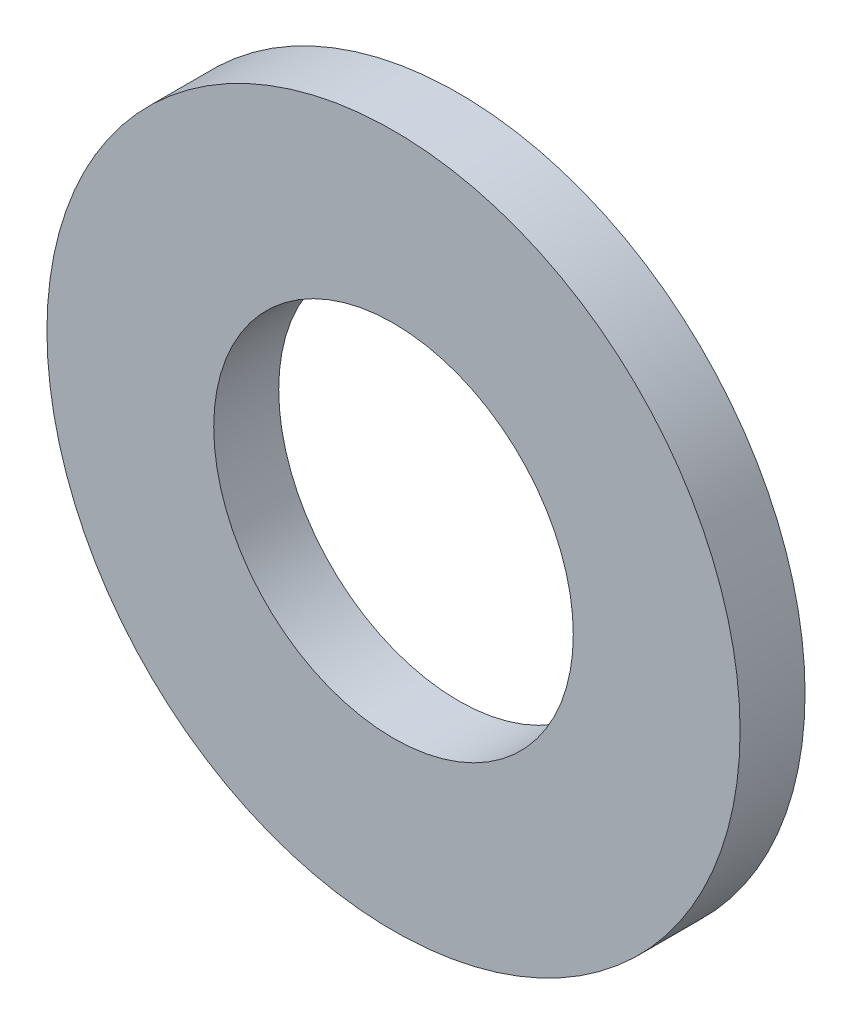
ISO-10303-21;
HEADER;
FILE_DESCRIPTION(('STEP AP214'),'2;1');
FILE_NAME('part.step','',(''),(''),'','','');
FILE_SCHEMA(('AUTOMOTIVE_DESIGN { 1 0 10303 214 1 1 1 1 }'));
ENDSEC;
DATA;
#1=APPLICATION_CONTEXT('core data for automotive mechanical design processes');
#2=APPLICATION_PROTOCOL_DEFINITION('international standard','automotive_design',2000,#1);
#3=PRODUCT_CONTEXT('',#1,'mechanical');
#4=PRODUCT('Part','Part','',(#3));
#5=PRODUCT_RELATED_PRODUCT_CATEGORY('part','',(#4));
#6=PRODUCT_DEFINITION_FORMATION('','',#4);
#7=PRODUCT_DEFINITION_CONTEXT('part definition',#1,'design');
#8=PRODUCT_DEFINITION('design','',#6,#7);
#9=PRODUCT_DEFINITION_SHAPE('','',#8);
#10=(LENGTH_UNIT() NAMED_UNIT(*) SI_UNIT(.MILLI.,.METRE.));
#11=(NAMED_UNIT(*) PLANE_ANGLE_UNIT() SI_UNIT($,.RADIAN.));
#12=(NAMED_UNIT(*) SI_UNIT($,.STERADIAN.) SOLID_ANGLE_UNIT());
#13=UNCERTAINTY_MEASURE_WITH_UNIT(LENGTH_MEASURE(1.E-05),#10,'distance_accuracy_value','');
#14=(GEOMETRIC_REPRESENTATION_CONTEXT(3) GLOBAL_UNCERTAINTY_ASSIGNED_CONTEXT((#13)) GLOBAL_UNIT_ASSIGNED_CONTEXT((#10,
#11,#12)) REPRESENTATION_CONTEXT('',''));
#15=CARTESIAN_POINT('',(0.,0.,0.));
#16=DIRECTION('',(0.,0.,1.));
#17=DIRECTION('',(1.,0.,0.));
#18=AXIS2_PLACEMENT_3D('',#15,#16,#17);
#19=CARTESIAN_POINT('',(0.,0.,0.));
#20=DIRECTION('',(0.,0.,1.));
#21=DIRECTION('',(1.,0.,0.));
#22=AXIS2_PLACEMENT_3D('',#19,#20,#21);
#23=PLANE('',#22);
#24=CARTESIAN_POINT('',(0.,0.,0.));
#25=DIRECTION('',(0.,0.,1.));
#26=DIRECTION('',(1.,0.,0.));
#27=AXIS2_PLACEMENT_3D('',#24,#25,#26);
#28=CIRCLE('',#27,4.15);
#29=CARTESIAN_POINT('',(4.15,0.,0.));
#30=VERTEX_POINT('',#29);
#31=EDGE_CURVE('E30',#30,#30,#28,.T.);
#32=ORIENTED_EDGE('',*,*,#31,.T.);
#33=EDGE_LOOP('',(#32));
#34=FACE_BOUND('',#33,.T.);
#35=CARTESIAN_POINT('',(0.,0.,0.));
#36=DIRECTION('',(0.,0.,1.));
#37=DIRECTION('',(1.,0.,0.));
#38=AXIS2_PLACEMENT_3D('',#35,#36,#37);
#39=CIRCLE('',#38,8.);
#40=CARTESIAN_POINT('',(8.,0.,0.));
#41=VERTEX_POINT('',#40);
#42=EDGE_CURVE('E17',#41,#41,#39,.T.);
#43=ORIENTED_EDGE('',*,*,#42,.F.);
#44=EDGE_LOOP('',(#43));
#45=FACE_BOUND('',#44,.T.);
#46=ADVANCED_FACE('F14',(#34,#45),#23,.F.);
#47=CARTESIAN_POINT('',(0.,0.,0.));
#48=DIRECTION('',(0.,0.,1.));
#49=DIRECTION('',(1.,0.,0.));
#50=AXIS2_PLACEMENT_3D('',#47,#48,#49);
#51=CYLINDRICAL_SURFACE('',#50,8.);
#52=ORIENTED_EDGE('',*,*,#42,.T.);
#53=EDGE_LOOP('',(#52));
#54=FACE_BOUND('',#53,.T.);
#55=CARTESIAN_POINT('',(0.,0.,1.5));
#56=DIRECTION('',(0.,0.,1.));
#57=DIRECTION('',(1.,0.,0.));
#58=AXIS2_PLACEMENT_3D('',#55,#56,#57);
#59=CIRCLE('',#58,8.);
#60=CARTESIAN_POINT('',(8.,0.,1.5));
#61=VERTEX_POINT('',#60);
#62=EDGE_CURVE('E22',#61,#61,#59,.T.);
#63=ORIENTED_EDGE('',*,*,#62,.F.);
#64=EDGE_LOOP('',(#63));
#65=FACE_BOUND('',#64,.T.);
#66=ADVANCED_FACE('F39',(#54,#65),#51,.T.);
#67=CARTESIAN_POINT('',(0.,0.,0.));
#68=DIRECTION('',(0.,0.,1.));
#69=DIRECTION('',(1.,0.,0.));
#70=AXIS2_PLACEMENT_3D('',#67,#68,#69);
#71=CYLINDRICAL_SURFACE('',#70,4.15);
#72=ORIENTED_EDGE('',*,*,#31,.F.);
#73=EDGE_LOOP('',(#72));
#74=FACE_BOUND('',#73,.T.);
#75=CARTESIAN_POINT('',(0.,0.,1.5));
#76=DIRECTION('',(0.,0.,1.));
#77=DIRECTION('',(1.,0.,0.));
#78=AXIS2_PLACEMENT_3D('',#75,#76,#77);
#79=CIRCLE('',#78,4.15);
#80=CARTESIAN_POINT('',(4.15,0.,1.5));
#81=VERTEX_POINT('',#80);
#82=EDGE_CURVE('E10',#81,#81,#79,.F.);
#83=ORIENTED_EDGE('',*,*,#82,.F.);
#84=EDGE_LOOP('',(#83));
#85=FACE_BOUND('',#84,.T.);
#86=ADVANCED_FACE('F47',(#74,#85),#71,.F.);
#87=CARTESIAN_POINT('',(0.,0.,1.5));
#88=DIRECTION('',(0.,0.,1.));
#89=DIRECTION('',(1.,0.,0.));
#90=AXIS2_PLACEMENT_3D('',#87,#88,#89);
#91=PLANE('',#90);
#92=ORIENTED_EDGE('',*,*,#82,.T.);
#93=EDGE_LOOP('',(#92));
#94=FACE_BOUND('',#93,.T.);
#95=ORIENTED_EDGE('',*,*,#62,.T.);
#96=EDGE_LOOP('',(#95));
#97=FACE_BOUND('',#96,.T.);
#98=ADVANCED_FACE('F48',(#94,#97),#91,.T.);
#99=CLOSED_SHELL('',(#46,#66,#86,#98));
#100=MANIFOLD_SOLID_BREP('B1',#99);
#101=ADVANCED_BREP_SHAPE_REPRESENTATION('',(#18,#100),#14);
#102=SHAPE_DEFINITION_REPRESENTATION(#9,#101);
ENDSEC;
END-ISO-10303-21;
